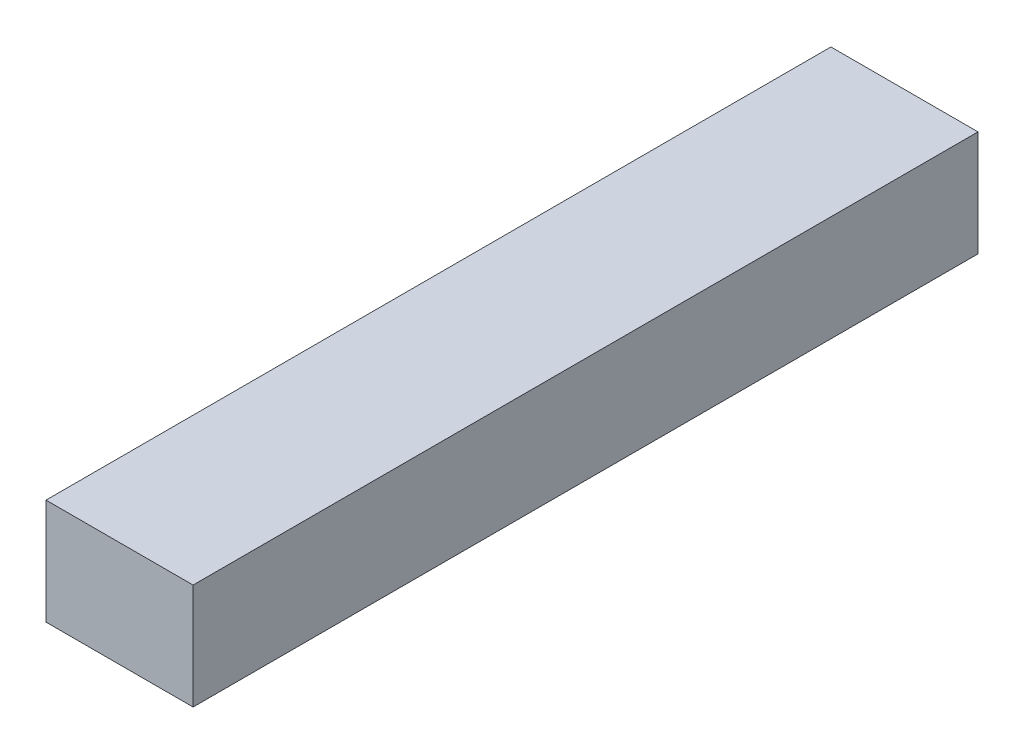
ISO-10303-21;
HEADER;
FILE_DESCRIPTION(('STEP AP214'),'2;1');
FILE_NAME('part.step','',(''),(''),'','','');
FILE_SCHEMA(('AUTOMOTIVE_DESIGN { 1 0 10303 214 1 1 1 1 }'));
ENDSEC;
DATA;
#1=APPLICATION_CONTEXT('core data for automotive mechanical design processes');
#2=APPLICATION_PROTOCOL_DEFINITION('international standard','automotive_design',2000,#1);
#3=PRODUCT_CONTEXT('',#1,'mechanical');
#4=PRODUCT('Part','Part','',(#3));
#5=PRODUCT_RELATED_PRODUCT_CATEGORY('part','',(#4));
#6=PRODUCT_DEFINITION_FORMATION('','',#4);
#7=PRODUCT_DEFINITION_CONTEXT('part definition',#1,'design');
#8=PRODUCT_DEFINITION('design','',#6,#7);
#9=PRODUCT_DEFINITION_SHAPE('','',#8);
#10=(LENGTH_UNIT() NAMED_UNIT(*) SI_UNIT(.MILLI.,.METRE.));
#11=(NAMED_UNIT(*) PLANE_ANGLE_UNIT() SI_UNIT($,.RADIAN.));
#12=(NAMED_UNIT(*) SI_UNIT($,.STERADIAN.) SOLID_ANGLE_UNIT());
#13=UNCERTAINTY_MEASURE_WITH_UNIT(LENGTH_MEASURE(1.E-05),#10,'distance_accuracy_value','');
#14=(GEOMETRIC_REPRESENTATION_CONTEXT(3) GLOBAL_UNCERTAINTY_ASSIGNED_CONTEXT((#13)) GLOBAL_UNIT_ASSIGNED_CONTEXT((#10,
#11,#12)) REPRESENTATION_CONTEXT('',''));
#15=CARTESIAN_POINT('',(0.,0.,0.));
#16=DIRECTION('',(0.,0.,1.));
#17=DIRECTION('',(1.,0.,0.));
#18=AXIS2_PLACEMENT_3D('',#15,#16,#17);
#19=CARTESIAN_POINT('',(-2.38,-1.71,25.4));
#20=DIRECTION('',(1.,0.,0.));
#21=DIRECTION('',(0.,0.,-1.));
#22=AXIS2_PLACEMENT_3D('',#19,#20,#21);
#23=PLANE('',#22);
#24=DIRECTION('',(0.,-1.,0.));
#25=VECTOR('',#24,1.);
#26=CARTESIAN_POINT('',(-2.38,-1.71,0.));
#27=LINE('',#26,#25);
#28=CARTESIAN_POINT('',(-2.38,1.71,0.));
#29=VERTEX_POINT('',#28);
#30=CARTESIAN_POINT('',(-2.38,-1.71,0.));
#31=VERTEX_POINT('',#30);
#32=EDGE_CURVE('E96',#29,#31,#27,.T.);
#33=ORIENTED_EDGE('',*,*,#32,.T.);
#34=DIRECTION('',(0.,0.,-1.));
#35=VECTOR('',#34,1.);
#36=CARTESIAN_POINT('',(-2.38,-1.71,25.4));
#37=LINE('',#36,#35);
#38=CARTESIAN_POINT('',(-2.38,-1.71,25.4));
#39=VERTEX_POINT('',#38);
#40=EDGE_CURVE('E11',#39,#31,#37,.T.);
#41=ORIENTED_EDGE('',*,*,#40,.F.);
#42=DIRECTION('',(0.,-1.,0.));
#43=VECTOR('',#42,1.);
#44=CARTESIAN_POINT('',(-2.38,-1.71,25.4));
#45=LINE('',#44,#43);
#46=CARTESIAN_POINT('',(-2.38,1.71,25.4));
#47=VERTEX_POINT('',#46);
#48=EDGE_CURVE('E84',#47,#39,#45,.T.);
#49=ORIENTED_EDGE('',*,*,#48,.F.);
#50=DIRECTION('',(0.,0.,-1.));
#51=VECTOR('',#50,1.);
#52=CARTESIAN_POINT('',(-2.38,1.71,25.4));
#53=LINE('',#52,#51);
#54=EDGE_CURVE('E92',#47,#29,#53,.T.);
#55=ORIENTED_EDGE('',*,*,#54,.T.);
#56=EDGE_LOOP('',(#33,#41,#49,#55));
#57=FACE_BOUND('',#56,.T.);
#58=ADVANCED_FACE('F33',(#57),#23,.F.);
#59=CARTESIAN_POINT('',(2.38,-1.71,25.4));
#60=DIRECTION('',(0.,1.,0.));
#61=DIRECTION('',(0.,0.,1.));
#62=AXIS2_PLACEMENT_3D('',#59,#60,#61);
#63=PLANE('',#62);
#64=DIRECTION('',(1.,0.,0.));
#65=VECTOR('',#64,1.);
#66=CARTESIAN_POINT('',(2.38,-1.71,0.));
#67=LINE('',#66,#65);
#68=CARTESIAN_POINT('',(2.38,-1.71,0.));
#69=VERTEX_POINT('',#68);
#70=EDGE_CURVE('E88',#31,#69,#67,.T.);
#71=ORIENTED_EDGE('',*,*,#70,.T.);
#72=DIRECTION('',(0.,0.,-1.));
#73=VECTOR('',#72,1.);
#74=CARTESIAN_POINT('',(2.38,-1.71,25.4));
#75=LINE('',#74,#73);
#76=CARTESIAN_POINT('',(2.38,-1.71,25.4));
#77=VERTEX_POINT('',#76);
#78=EDGE_CURVE('E41',#77,#69,#75,.T.);
#79=ORIENTED_EDGE('',*,*,#78,.F.);
#80=DIRECTION('',(1.,0.,0.));
#81=VECTOR('',#80,1.);
#82=CARTESIAN_POINT('',(2.38,-1.71,25.4));
#83=LINE('',#82,#81);
#84=EDGE_CURVE('E79',#39,#77,#83,.T.);
#85=ORIENTED_EDGE('',*,*,#84,.F.);
#86=ORIENTED_EDGE('',*,*,#40,.T.);
#87=EDGE_LOOP('',(#71,#79,#85,#86));
#88=FACE_BOUND('',#87,.T.);
#89=ADVANCED_FACE('F87',(#88),#63,.F.);
#90=CARTESIAN_POINT('',(2.38,-1.71,25.4));
#91=DIRECTION('',(-1.,0.,0.));
#92=DIRECTION('',(0.,0.,1.));
#93=AXIS2_PLACEMENT_3D('',#90,#91,#92);
#94=PLANE('',#93);
#95=DIRECTION('',(0.,1.,0.));
#96=VECTOR('',#95,1.);
#97=CARTESIAN_POINT('',(2.38,-1.71,0.));
#98=LINE('',#97,#96);
#99=CARTESIAN_POINT('',(2.38,1.71,0.));
#100=VERTEX_POINT('',#99);
#101=EDGE_CURVE('E66',#69,#100,#98,.T.);
#102=ORIENTED_EDGE('',*,*,#101,.T.);
#103=DIRECTION('',(0.,0.,-1.));
#104=VECTOR('',#103,1.);
#105=CARTESIAN_POINT('',(2.38,1.71,25.4));
#106=LINE('',#105,#104);
#107=CARTESIAN_POINT('',(2.38,1.71,25.4));
#108=VERTEX_POINT('',#107);
#109=EDGE_CURVE('E89',#108,#100,#106,.T.);
#110=ORIENTED_EDGE('',*,*,#109,.F.);
#111=DIRECTION('',(0.,1.,0.));
#112=VECTOR('',#111,1.);
#113=CARTESIAN_POINT('',(2.38,-1.71,25.4));
#114=LINE('',#113,#112);
#115=EDGE_CURVE('E82',#77,#108,#114,.T.);
#116=ORIENTED_EDGE('',*,*,#115,.F.);
#117=ORIENTED_EDGE('',*,*,#78,.T.);
#118=EDGE_LOOP('',(#102,#110,#116,#117));
#119=FACE_BOUND('',#118,.T.);
#120=ADVANCED_FACE('F90',(#119),#94,.F.);
#121=CARTESIAN_POINT('',(2.38,1.71,25.4));
#122=DIRECTION('',(0.,-1.,0.));
#123=DIRECTION('',(0.,0.,-1.));
#124=AXIS2_PLACEMENT_3D('',#121,#122,#123);
#125=PLANE('',#124);
#126=DIRECTION('',(-1.,0.,0.));
#127=VECTOR('',#126,1.);
#128=CARTESIAN_POINT('',(2.38,1.71,0.));
#129=LINE('',#128,#127);
#130=EDGE_CURVE('E72',#100,#29,#129,.T.);
#131=ORIENTED_EDGE('',*,*,#130,.T.);
#132=ORIENTED_EDGE('',*,*,#54,.F.);
#133=DIRECTION('',(-1.,0.,0.));
#134=VECTOR('',#133,1.);
#135=CARTESIAN_POINT('',(2.38,1.71,25.4));
#136=LINE('',#135,#134);
#137=EDGE_CURVE('E49',#108,#47,#136,.T.);
#138=ORIENTED_EDGE('',*,*,#137,.F.);
#139=ORIENTED_EDGE('',*,*,#109,.T.);
#140=EDGE_LOOP('',(#131,#132,#138,#139));
#141=FACE_BOUND('',#140,.T.);
#142=ADVANCED_FACE('F103',(#141),#125,.F.);
#143=CARTESIAN_POINT('',(0.,0.,25.4));
#144=DIRECTION('',(0.,0.,1.));
#145=DIRECTION('',(1.,0.,0.));
#146=AXIS2_PLACEMENT_3D('',#143,#144,#145);
#147=PLANE('',#146);
#148=ORIENTED_EDGE('',*,*,#48,.T.);
#149=ORIENTED_EDGE('',*,*,#84,.T.);
#150=ORIENTED_EDGE('',*,*,#115,.T.);
#151=ORIENTED_EDGE('',*,*,#137,.T.);
#152=EDGE_LOOP('',(#148,#149,#150,#151));
#153=FACE_BOUND('',#152,.T.);
#154=ADVANCED_FACE('F80',(#153),#147,.T.);
#155=CARTESIAN_POINT('',(0.,0.,0.));
#156=DIRECTION('',(0.,0.,1.));
#157=DIRECTION('',(1.,0.,0.));
#158=AXIS2_PLACEMENT_3D('',#155,#156,#157);
#159=PLANE('',#158);
#160=ORIENTED_EDGE('',*,*,#32,.F.);
#161=ORIENTED_EDGE('',*,*,#130,.F.);
#162=ORIENTED_EDGE('',*,*,#101,.F.);
#163=ORIENTED_EDGE('',*,*,#70,.F.);
#164=EDGE_LOOP('',(#160,#161,#162,#163));
#165=FACE_BOUND('',#164,.T.);
#166=ADVANCED_FACE('F106',(#165),#159,.F.);
#167=CLOSED_SHELL('',(#58,#89,#120,#142,#154,#166));
#168=MANIFOLD_SOLID_BREP('B2',#167);
#169=ADVANCED_BREP_SHAPE_REPRESENTATION('',(#18,#168),#14);
#170=SHAPE_DEFINITION_REPRESENTATION(#9,#169);
ENDSEC;
END-ISO-10303-21;
